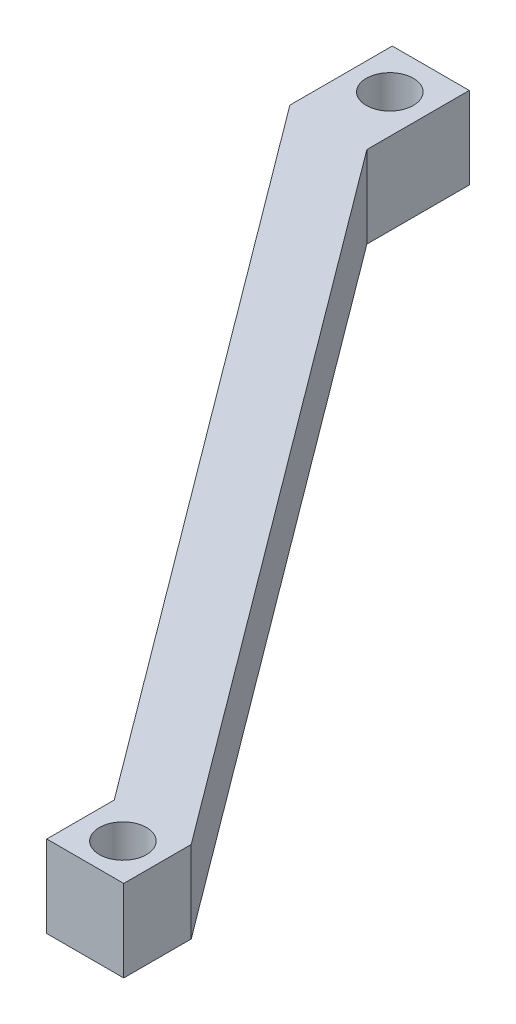
ISO-10303-21;
HEADER;
FILE_DESCRIPTION(('STEP AP214'),'2;1');
FILE_NAME('part.step','',(''),(''),'','','');
FILE_SCHEMA(('AUTOMOTIVE_DESIGN { 1 0 10303 214 1 1 1 1 }'));
ENDSEC;
DATA;
#1=APPLICATION_CONTEXT('core data for automotive mechanical design processes');
#2=APPLICATION_PROTOCOL_DEFINITION('international standard','automotive_design',2000,#1);
#3=PRODUCT_CONTEXT('',#1,'mechanical');
#4=PRODUCT('Part','Part','',(#3));
#5=PRODUCT_RELATED_PRODUCT_CATEGORY('part','',(#4));
#6=PRODUCT_DEFINITION_FORMATION('','',#4);
#7=PRODUCT_DEFINITION_CONTEXT('part definition',#1,'design');
#8=PRODUCT_DEFINITION('design','',#6,#7);
#9=PRODUCT_DEFINITION_SHAPE('','',#8);
#10=(LENGTH_UNIT() NAMED_UNIT(*) SI_UNIT(.MILLI.,.METRE.));
#11=(NAMED_UNIT(*) PLANE_ANGLE_UNIT() SI_UNIT($,.RADIAN.));
#12=(NAMED_UNIT(*) SI_UNIT($,.STERADIAN.) SOLID_ANGLE_UNIT());
#13=UNCERTAINTY_MEASURE_WITH_UNIT(LENGTH_MEASURE(1.E-05),#10,'distance_accuracy_value','');
#14=(GEOMETRIC_REPRESENTATION_CONTEXT(3) GLOBAL_UNCERTAINTY_ASSIGNED_CONTEXT((#13)) GLOBAL_UNIT_ASSIGNED_CONTEXT((#10,
#11,#12)) REPRESENTATION_CONTEXT('',''));
#15=CARTESIAN_POINT('',(0.,0.,0.));
#16=DIRECTION('',(0.,0.,1.));
#17=DIRECTION('',(1.,0.,0.));
#18=AXIS2_PLACEMENT_3D('',#15,#16,#17);
#19=CARTESIAN_POINT('',(-9.39690238414134,20.,-9.99999999999999));
#20=DIRECTION('',(0.,0.,1.));
#21=DIRECTION('',(1.,0.,0.));
#22=AXIS2_PLACEMENT_3D('',#19,#20,#21);
#23=PLANE('',#22);
#24=DIRECTION('',(-1.,0.,0.));
#25=VECTOR('',#24,1.);
#26=CARTESIAN_POINT('',(-9.39690238414134,0.,-9.99999999999999));
#27=LINE('',#26,#25);
#28=CARTESIAN_POINT('',(9.39690238414134,0.,-9.99999999999999));
#29=VERTEX_POINT('',#28);
#30=CARTESIAN_POINT('',(-9.39690238414134,0.,-9.99999999999999));
#31=VERTEX_POINT('',#30);
#32=EDGE_CURVE('E142',#29,#31,#27,.T.);
#33=ORIENTED_EDGE('',*,*,#32,.T.);
#34=DIRECTION('',(0.,-1.,0.));
#35=VECTOR('',#34,1.);
#36=CARTESIAN_POINT('',(-9.39690238414134,20.,-9.99999999999999));
#37=LINE('',#36,#35);
#38=CARTESIAN_POINT('',(-9.39690238414134,20.,-9.99999999999999));
#39=VERTEX_POINT('',#38);
#40=EDGE_CURVE('E11',#39,#31,#37,.T.);
#41=ORIENTED_EDGE('',*,*,#40,.F.);
#42=DIRECTION('',(-1.,0.,0.));
#43=VECTOR('',#42,1.);
#44=CARTESIAN_POINT('',(-9.39690238414134,20.,-9.99999999999999));
#45=LINE('',#44,#43);
#46=CARTESIAN_POINT('',(9.39690238414134,20.,-9.99999999999999));
#47=VERTEX_POINT('',#46);
#48=EDGE_CURVE('E165',#47,#39,#45,.T.);
#49=ORIENTED_EDGE('',*,*,#48,.F.);
#50=DIRECTION('',(0.,-1.,0.));
#51=VECTOR('',#50,1.);
#52=CARTESIAN_POINT('',(9.39690238414134,20.,-9.99999999999999));
#53=LINE('',#52,#51);
#54=EDGE_CURVE('E138',#47,#29,#53,.T.);
#55=ORIENTED_EDGE('',*,*,#54,.T.);
#56=EDGE_LOOP('',(#33,#41,#49,#55));
#57=FACE_BOUND('',#56,.T.);
#58=ADVANCED_FACE('F41',(#57),#23,.F.);
#59=CARTESIAN_POINT('',(-9.39690238414137,20.,15.));
#60=DIRECTION('',(1.,0.,0.));
#61=DIRECTION('',(0.,0.,-1.));
#62=AXIS2_PLACEMENT_3D('',#59,#60,#61);
#63=PLANE('',#62);
#64=DIRECTION('',(0.,0.,1.));
#65=VECTOR('',#64,1.);
#66=CARTESIAN_POINT('',(-9.39690238414137,0.,15.));
#67=LINE('',#66,#65);
#68=CARTESIAN_POINT('',(-9.39690238414137,0.,15.));
#69=VERTEX_POINT('',#68);
#70=EDGE_CURVE('E146',#31,#69,#67,.T.);
#71=ORIENTED_EDGE('',*,*,#70,.T.);
#72=DIRECTION('',(0.,-1.,0.));
#73=VECTOR('',#72,1.);
#74=CARTESIAN_POINT('',(-9.39690238414137,20.,15.));
#75=LINE('',#74,#73);
#76=CARTESIAN_POINT('',(-9.39690238414137,20.,15.));
#77=VERTEX_POINT('',#76);
#78=EDGE_CURVE('E50',#77,#69,#75,.T.);
#79=ORIENTED_EDGE('',*,*,#78,.F.);
#80=DIRECTION('',(0.,0.,1.));
#81=VECTOR('',#80,1.);
#82=CARTESIAN_POINT('',(-9.39690238414137,20.,15.));
#83=LINE('',#82,#81);
#84=EDGE_CURVE('E101',#39,#77,#83,.T.);
#85=ORIENTED_EDGE('',*,*,#84,.F.);
#86=ORIENTED_EDGE('',*,*,#40,.T.);
#87=EDGE_LOOP('',(#71,#79,#85,#86));
#88=FACE_BOUND('',#87,.T.);
#89=ADVANCED_FACE('F249',(#88),#63,.F.);
#90=CARTESIAN_POINT('',(116.093254939705,20.,183.381175951578));
#91=DIRECTION('',(0.801815123578942,0.,-0.597572177732603));
#92=DIRECTION('',(-0.597572177732603,0.,-0.801815123578943));
#93=AXIS2_PLACEMENT_3D('',#90,#91,#92);
#94=PLANE('',#93);
#95=DIRECTION('',(0.597572177732603,0.,0.801815123578943));
#96=VECTOR('',#95,1.);
#97=CARTESIAN_POINT('',(116.093254939705,0.,183.381175951578));
#98=LINE('',#97,#96);
#99=CARTESIAN_POINT('',(116.093254939705,0.,183.381175951578));
#100=VERTEX_POINT('',#99);
#101=EDGE_CURVE('E150',#69,#100,#98,.T.);
#102=ORIENTED_EDGE('',*,*,#101,.T.);
#103=DIRECTION('',(0.,-1.,0.));
#104=VECTOR('',#103,1.);
#105=CARTESIAN_POINT('',(116.093254939705,20.,183.381175951578));
#106=LINE('',#105,#104);
#107=CARTESIAN_POINT('',(116.093254939705,20.,183.381175951578));
#108=VERTEX_POINT('',#107);
#109=EDGE_CURVE('E176',#108,#100,#106,.T.);
#110=ORIENTED_EDGE('',*,*,#109,.F.);
#111=DIRECTION('',(0.597572177732603,0.,0.801815123578943));
#112=VECTOR('',#111,1.);
#113=CARTESIAN_POINT('',(116.093254939705,20.,183.381175951578));
#114=LINE('',#113,#112);
#115=EDGE_CURVE('E186',#77,#108,#114,.T.);
#116=ORIENTED_EDGE('',*,*,#115,.F.);
#117=ORIENTED_EDGE('',*,*,#78,.T.);
#118=EDGE_LOOP('',(#102,#110,#116,#117));
#119=FACE_BOUND('',#118,.T.);
#120=ADVANCED_FACE('F184',(#119),#94,.F.);
#121=CARTESIAN_POINT('',(116.093254939705,20.,199.855922102069));
#122=DIRECTION('',(1.,0.,0.));
#123=DIRECTION('',(0.,0.,-1.));
#124=AXIS2_PLACEMENT_3D('',#121,#122,#123);
#125=PLANE('',#124);
#126=DIRECTION('',(0.,0.,1.));
#127=VECTOR('',#126,1.);
#128=CARTESIAN_POINT('',(116.093254939705,0.,199.855922102069));
#129=LINE('',#128,#127);
#130=CARTESIAN_POINT('',(116.093254939705,0.,199.855922102069));
#131=VERTEX_POINT('',#130);
#132=EDGE_CURVE('E153',#100,#131,#129,.T.);
#133=ORIENTED_EDGE('',*,*,#132,.T.);
#134=DIRECTION('',(0.,-1.,0.));
#135=VECTOR('',#134,1.);
#136=CARTESIAN_POINT('',(116.093254939705,20.,199.855922102069));
#137=LINE('',#136,#135);
#138=CARTESIAN_POINT('',(116.093254939705,20.,199.855922102069));
#139=VERTEX_POINT('',#138);
#140=EDGE_CURVE('E172',#139,#131,#137,.T.);
#141=ORIENTED_EDGE('',*,*,#140,.F.);
#142=DIRECTION('',(0.,0.,1.));
#143=VECTOR('',#142,1.);
#144=CARTESIAN_POINT('',(116.093254939705,20.,199.855922102069));
#145=LINE('',#144,#143);
#146=EDGE_CURVE('E199',#108,#139,#145,.T.);
#147=ORIENTED_EDGE('',*,*,#146,.F.);
#148=ORIENTED_EDGE('',*,*,#109,.T.);
#149=EDGE_LOOP('',(#133,#141,#147,#148));
#150=FACE_BOUND('',#149,.T.);
#151=ADVANCED_FACE('F194',(#150),#125,.F.);
#152=CARTESIAN_POINT('',(134.887059707988,20.,199.855922102069));
#153=DIRECTION('',(0.,0.,-1.));
#154=DIRECTION('',(-1.,0.,0.));
#155=AXIS2_PLACEMENT_3D('',#152,#153,#154);
#156=PLANE('',#155);
#157=DIRECTION('',(1.,0.,0.));
#158=VECTOR('',#157,1.);
#159=CARTESIAN_POINT('',(134.887059707988,0.,199.855922102069));
#160=LINE('',#159,#158);
#161=CARTESIAN_POINT('',(134.887059707988,0.,199.855922102069));
#162=VERTEX_POINT('',#161);
#163=EDGE_CURVE('E156',#131,#162,#160,.T.);
#164=ORIENTED_EDGE('',*,*,#163,.T.);
#165=DIRECTION('',(0.,-1.,0.));
#166=VECTOR('',#165,1.);
#167=CARTESIAN_POINT('',(134.887059707988,20.,199.855922102069));
#168=LINE('',#167,#166);
#169=CARTESIAN_POINT('',(134.887059707988,20.,199.855922102069));
#170=VERTEX_POINT('',#169);
#171=EDGE_CURVE('E131',#170,#162,#168,.T.);
#172=ORIENTED_EDGE('',*,*,#171,.F.);
#173=DIRECTION('',(1.,0.,0.));
#174=VECTOR('',#173,1.);
#175=CARTESIAN_POINT('',(134.887059707988,20.,199.855922102069));
#176=LINE('',#175,#174);
#177=EDGE_CURVE('E120',#139,#170,#176,.T.);
#178=ORIENTED_EDGE('',*,*,#177,.F.);
#179=ORIENTED_EDGE('',*,*,#140,.T.);
#180=EDGE_LOOP('',(#164,#172,#178,#179));
#181=FACE_BOUND('',#180,.T.);
#182=ADVANCED_FACE('F197',(#181),#156,.F.);
#183=CARTESIAN_POINT('',(134.887059707988,20.,183.381175951578));
#184=DIRECTION('',(-1.,0.,0.));
#185=DIRECTION('',(0.,0.,1.));
#186=AXIS2_PLACEMENT_3D('',#183,#184,#185);
#187=PLANE('',#186);
#188=DIRECTION('',(0.,0.,-1.));
#189=VECTOR('',#188,1.);
#190=CARTESIAN_POINT('',(134.887059707988,0.,183.381175951578));
#191=LINE('',#190,#189);
#192=CARTESIAN_POINT('',(134.887059707988,0.,183.381175951578));
#193=VERTEX_POINT('',#192);
#194=EDGE_CURVE('E129',#162,#193,#191,.T.);
#195=ORIENTED_EDGE('',*,*,#194,.T.);
#196=DIRECTION('',(0.,-1.,0.));
#197=VECTOR('',#196,1.);
#198=CARTESIAN_POINT('',(134.887059707988,20.,183.381175951578));
#199=LINE('',#198,#197);
#200=CARTESIAN_POINT('',(134.887059707988,20.,183.381175951578));
#201=VERTEX_POINT('',#200);
#202=EDGE_CURVE('E126',#201,#193,#199,.T.);
#203=ORIENTED_EDGE('',*,*,#202,.F.);
#204=DIRECTION('',(0.,0.,-1.));
#205=VECTOR('',#204,1.);
#206=CARTESIAN_POINT('',(134.887059707988,20.,183.381175951578));
#207=LINE('',#206,#205);
#208=EDGE_CURVE('E114',#170,#201,#207,.T.);
#209=ORIENTED_EDGE('',*,*,#208,.F.);
#210=ORIENTED_EDGE('',*,*,#171,.T.);
#211=EDGE_LOOP('',(#195,#203,#209,#210));
#212=FACE_BOUND('',#211,.T.);
#213=ADVANCED_FACE('F127',(#212),#187,.F.);
#214=CARTESIAN_POINT('',(9.39690238414134,20.,15.));
#215=DIRECTION('',(-0.801815123578942,0.,0.597572177732603));
#216=DIRECTION('',(0.597572177732603,0.,0.801815123578943));
#217=AXIS2_PLACEMENT_3D('',#214,#215,#216);
#218=PLANE('',#217);
#219=DIRECTION('',(-0.597572177732603,0.,-0.801815123578943));
#220=VECTOR('',#219,1.);
#221=CARTESIAN_POINT('',(9.39690238414134,0.,15.));
#222=LINE('',#221,#220);
#223=CARTESIAN_POINT('',(9.39690238414134,0.,15.));
#224=VERTEX_POINT('',#223);
#225=EDGE_CURVE('E87',#193,#224,#222,.T.);
#226=ORIENTED_EDGE('',*,*,#225,.T.);
#227=DIRECTION('',(0.,-1.,0.));
#228=VECTOR('',#227,1.);
#229=CARTESIAN_POINT('',(9.39690238414134,20.,15.));
#230=LINE('',#229,#228);
#231=CARTESIAN_POINT('',(9.39690238414134,20.,15.));
#232=VERTEX_POINT('',#231);
#233=EDGE_CURVE('E132',#232,#224,#230,.T.);
#234=ORIENTED_EDGE('',*,*,#233,.F.);
#235=DIRECTION('',(-0.597572177732603,0.,-0.801815123578943));
#236=VECTOR('',#235,1.);
#237=CARTESIAN_POINT('',(9.39690238414134,20.,15.));
#238=LINE('',#237,#236);
#239=EDGE_CURVE('E118',#201,#232,#238,.T.);
#240=ORIENTED_EDGE('',*,*,#239,.F.);
#241=ORIENTED_EDGE('',*,*,#202,.T.);
#242=EDGE_LOOP('',(#226,#234,#240,#241));
#243=FACE_BOUND('',#242,.T.);
#244=ADVANCED_FACE('F134',(#243),#218,.F.);
#245=CARTESIAN_POINT('',(9.39690238414134,20.,-9.99999999999999));
#246=DIRECTION('',(-1.,0.,0.));
#247=DIRECTION('',(0.,0.,1.));
#248=AXIS2_PLACEMENT_3D('',#245,#246,#247);
#249=PLANE('',#248);
#250=DIRECTION('',(0.,0.,-1.));
#251=VECTOR('',#250,1.);
#252=CARTESIAN_POINT('',(9.39690238414134,0.,-9.99999999999999));
#253=LINE('',#252,#251);
#254=EDGE_CURVE('E93',#224,#29,#253,.T.);
#255=ORIENTED_EDGE('',*,*,#254,.T.);
#256=ORIENTED_EDGE('',*,*,#54,.F.);
#257=DIRECTION('',(0.,0.,-1.));
#258=VECTOR('',#257,1.);
#259=CARTESIAN_POINT('',(9.39690238414134,20.,-9.99999999999999));
#260=LINE('',#259,#258);
#261=EDGE_CURVE('E58',#232,#47,#260,.T.);
#262=ORIENTED_EDGE('',*,*,#261,.F.);
#263=ORIENTED_EDGE('',*,*,#233,.T.);
#264=EDGE_LOOP('',(#255,#256,#262,#263));
#265=FACE_BOUND('',#264,.T.);
#266=ADVANCED_FACE('F236',(#265),#249,.F.);
#267=CARTESIAN_POINT('',(0.,20.,0.));
#268=DIRECTION('',(0.,-1.,0.));
#269=DIRECTION('',(0.,0.,-1.));
#270=AXIS2_PLACEMENT_3D('',#267,#268,#269);
#271=PLANE('',#270);
#272=CARTESIAN_POINT('',(0.,20.,0.));
#273=DIRECTION('',(0.,1.,0.));
#274=DIRECTION('',(0.,0.,1.));
#275=AXIS2_PLACEMENT_3D('',#272,#273,#274);
#276=CIRCLE('',#275,5.75);
#277=CARTESIAN_POINT('',(0.,20.,5.75));
#278=VERTEX_POINT('',#277);
#279=EDGE_CURVE('E217',#278,#278,#276,.T.);
#280=ORIENTED_EDGE('',*,*,#279,.F.);
#281=EDGE_LOOP('',(#280));
#282=FACE_BOUND('',#281,.T.);
#283=CARTESIAN_POINT('',(125.834728431197,20.,190.993349414703));
#284=DIRECTION('',(0.,1.,0.));
#285=DIRECTION('',(0.,0.,1.));
#286=AXIS2_PLACEMENT_3D('',#283,#284,#285);
#287=CIRCLE('',#286,5.75);
#288=CARTESIAN_POINT('',(125.834728431197,20.,196.743349414703));
#289=VERTEX_POINT('',#288);
#290=EDGE_CURVE('E209',#289,#289,#287,.T.);
#291=ORIENTED_EDGE('',*,*,#290,.F.);
#292=EDGE_LOOP('',(#291));
#293=FACE_BOUND('',#292,.T.);
#294=ORIENTED_EDGE('',*,*,#48,.T.);
#295=ORIENTED_EDGE('',*,*,#84,.T.);
#296=ORIENTED_EDGE('',*,*,#115,.T.);
#297=ORIENTED_EDGE('',*,*,#146,.T.);
#298=ORIENTED_EDGE('',*,*,#177,.T.);
#299=ORIENTED_EDGE('',*,*,#208,.T.);
#300=ORIENTED_EDGE('',*,*,#239,.T.);
#301=ORIENTED_EDGE('',*,*,#261,.T.);
#302=EDGE_LOOP('',(#294,#295,#296,#297,#298,#299,#300,#301));
#303=FACE_BOUND('',#302,.T.);
#304=ADVANCED_FACE('F116',(#282,#293,#303),#271,.F.);
#305=CARTESIAN_POINT('',(0.,0.,0.));
#306=DIRECTION('',(0.,-1.,0.));
#307=DIRECTION('',(0.,0.,-1.));
#308=AXIS2_PLACEMENT_3D('',#305,#306,#307);
#309=PLANE('',#308);
#310=CARTESIAN_POINT('',(0.,0.,0.));
#311=DIRECTION('',(0.,1.,0.));
#312=DIRECTION('',(0.,0.,1.));
#313=AXIS2_PLACEMENT_3D('',#310,#311,#312);
#314=CIRCLE('',#313,5.75);
#315=CARTESIAN_POINT('',(0.,0.,5.75));
#316=VERTEX_POINT('',#315);
#317=EDGE_CURVE('E147',#316,#316,#314,.T.);
#318=ORIENTED_EDGE('',*,*,#317,.T.);
#319=EDGE_LOOP('',(#318));
#320=FACE_BOUND('',#319,.T.);
#321=CARTESIAN_POINT('',(125.834728431197,0.,190.993349414703));
#322=DIRECTION('',(0.,1.,0.));
#323=DIRECTION('',(0.,0.,1.));
#324=AXIS2_PLACEMENT_3D('',#321,#322,#323);
#325=CIRCLE('',#324,5.75);
#326=CARTESIAN_POINT('',(125.834728431197,0.,196.743349414703));
#327=VERTEX_POINT('',#326);
#328=EDGE_CURVE('E213',#327,#327,#325,.T.);
#329=ORIENTED_EDGE('',*,*,#328,.T.);
#330=EDGE_LOOP('',(#329));
#331=FACE_BOUND('',#330,.T.);
#332=ORIENTED_EDGE('',*,*,#32,.F.);
#333=ORIENTED_EDGE('',*,*,#254,.F.);
#334=ORIENTED_EDGE('',*,*,#225,.F.);
#335=ORIENTED_EDGE('',*,*,#194,.F.);
#336=ORIENTED_EDGE('',*,*,#163,.F.);
#337=ORIENTED_EDGE('',*,*,#132,.F.);
#338=ORIENTED_EDGE('',*,*,#101,.F.);
#339=ORIENTED_EDGE('',*,*,#70,.F.);
#340=EDGE_LOOP('',(#332,#333,#334,#335,#336,#337,#338,#339));
#341=FACE_BOUND('',#340,.T.);
#342=ADVANCED_FACE('F190',(#320,#331,#341),#309,.T.);
#343=CARTESIAN_POINT('',(125.834728431197,0.,190.993349414703));
#344=DIRECTION('',(0.,1.,0.));
#345=DIRECTION('',(0.,0.,1.));
#346=AXIS2_PLACEMENT_3D('',#343,#344,#345);
#347=CYLINDRICAL_SURFACE('',#346,5.75);
#348=ORIENTED_EDGE('',*,*,#328,.F.);
#349=EDGE_LOOP('',(#348));
#350=FACE_BOUND('',#349,.T.);
#351=ORIENTED_EDGE('',*,*,#290,.T.);
#352=EDGE_LOOP('',(#351));
#353=FACE_BOUND('',#352,.T.);
#354=ADVANCED_FACE('F230',(#350,#353),#347,.F.);
#355=CARTESIAN_POINT('',(0.,0.,0.));
#356=DIRECTION('',(0.,1.,0.));
#357=DIRECTION('',(0.,0.,1.));
#358=AXIS2_PLACEMENT_3D('',#355,#356,#357);
#359=CYLINDRICAL_SURFACE('',#358,5.75);
#360=ORIENTED_EDGE('',*,*,#317,.F.);
#361=EDGE_LOOP('',(#360));
#362=FACE_BOUND('',#361,.T.);
#363=ORIENTED_EDGE('',*,*,#279,.T.);
#364=EDGE_LOOP('',(#363));
#365=FACE_BOUND('',#364,.T.);
#366=ADVANCED_FACE('F227',(#362,#365),#359,.F.);
#367=CLOSED_SHELL('',(#58,#89,#120,#151,#182,#213,#244,#266,#304,#342,#354,#366));
#368=MANIFOLD_SOLID_BREP('B2',#367);
#369=ADVANCED_BREP_SHAPE_REPRESENTATION('',(#18,#368),#14);
#370=SHAPE_DEFINITION_REPRESENTATION(#9,#369);
ENDSEC;
END-ISO-10303-21;
